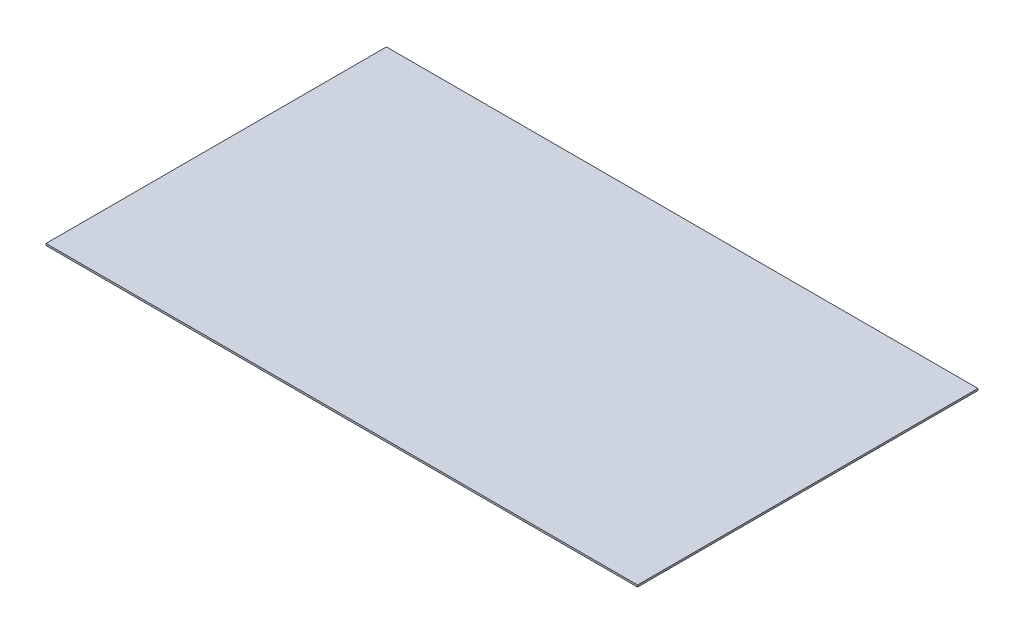
ISO-10303-21;
HEADER;
FILE_DESCRIPTION(('STEP AP214'),'2;1');
FILE_NAME('part.step','',(''),(''),'','','');
FILE_SCHEMA(('AUTOMOTIVE_DESIGN { 1 0 10303 214 1 1 1 1 }'));
ENDSEC;
DATA;
#1=APPLICATION_CONTEXT('core data for automotive mechanical design processes');
#2=APPLICATION_PROTOCOL_DEFINITION('international standard','automotive_design',2000,#1);
#3=PRODUCT_CONTEXT('',#1,'mechanical');
#4=PRODUCT('Part','Part','',(#3));
#5=PRODUCT_RELATED_PRODUCT_CATEGORY('part','',(#4));
#6=PRODUCT_DEFINITION_FORMATION('','',#4);
#7=PRODUCT_DEFINITION_CONTEXT('part definition',#1,'design');
#8=PRODUCT_DEFINITION('design','',#6,#7);
#9=PRODUCT_DEFINITION_SHAPE('','',#8);
#10=(LENGTH_UNIT() NAMED_UNIT(*) SI_UNIT(.MILLI.,.METRE.));
#11=(NAMED_UNIT(*) PLANE_ANGLE_UNIT() SI_UNIT($,.RADIAN.));
#12=(NAMED_UNIT(*) SI_UNIT($,.STERADIAN.) SOLID_ANGLE_UNIT());
#13=UNCERTAINTY_MEASURE_WITH_UNIT(LENGTH_MEASURE(1.E-05),#10,'distance_accuracy_value','');
#14=(GEOMETRIC_REPRESENTATION_CONTEXT(3) GLOBAL_UNCERTAINTY_ASSIGNED_CONTEXT((#13)) GLOBAL_UNIT_ASSIGNED_CONTEXT((#10,
#11,#12)) REPRESENTATION_CONTEXT('',''));
#15=CARTESIAN_POINT('',(0.,0.,0.));
#16=DIRECTION('',(0.,0.,1.));
#17=DIRECTION('',(1.,0.,0.));
#18=AXIS2_PLACEMENT_3D('',#15,#16,#17);
#19=CARTESIAN_POINT('',(213.853908578445,10.,-1756.08589725759));
#20=DIRECTION('',(-1.,0.,0.));
#21=DIRECTION('',(0.,0.,1.));
#22=AXIS2_PLACEMENT_3D('',#19,#20,#21);
#23=PLANE('',#22);
#24=DIRECTION('',(0.,0.,-1.));
#25=VECTOR('',#24,1.);
#26=CARTESIAN_POINT('',(213.853908578445,0.,-1756.08589725759));
#27=LINE('',#26,#25);
#28=CARTESIAN_POINT('',(213.853908578445,0.,91.5704236200257));
#29=VERTEX_POINT('',#28);
#30=CARTESIAN_POINT('',(213.853908578445,0.,-1756.08589725759));
#31=VERTEX_POINT('',#30);
#32=EDGE_CURVE('E96',#29,#31,#27,.T.);
#33=ORIENTED_EDGE('',*,*,#32,.T.);
#34=DIRECTION('',(0.,-1.,0.));
#35=VECTOR('',#34,1.);
#36=CARTESIAN_POINT('',(213.853908578445,10.,-1756.08589725759));
#37=LINE('',#36,#35);
#38=CARTESIAN_POINT('',(213.853908578445,10.,-1756.08589725759));
#39=VERTEX_POINT('',#38);
#40=EDGE_CURVE('E11',#39,#31,#37,.T.);
#41=ORIENTED_EDGE('',*,*,#40,.F.);
#42=DIRECTION('',(0.,0.,-1.));
#43=VECTOR('',#42,1.);
#44=CARTESIAN_POINT('',(213.853908578445,10.,-1756.08589725759));
#45=LINE('',#44,#43);
#46=CARTESIAN_POINT('',(213.853908578445,10.,91.5704236200257));
#47=VERTEX_POINT('',#46);
#48=EDGE_CURVE('E84',#47,#39,#45,.T.);
#49=ORIENTED_EDGE('',*,*,#48,.F.);
#50=DIRECTION('',(0.,-1.,0.));
#51=VECTOR('',#50,1.);
#52=CARTESIAN_POINT('',(213.853908578445,10.,91.5704236200257));
#53=LINE('',#52,#51);
#54=EDGE_CURVE('E92',#47,#29,#53,.T.);
#55=ORIENTED_EDGE('',*,*,#54,.T.);
#56=EDGE_LOOP('',(#33,#41,#49,#55));
#57=FACE_BOUND('',#56,.T.);
#58=ADVANCED_FACE('F33',(#57),#23,.F.);
#59=CARTESIAN_POINT('',(-2996.9130581941,10.,-1756.08589725759));
#60=DIRECTION('',(0.,0.,1.));
#61=DIRECTION('',(1.,0.,0.));
#62=AXIS2_PLACEMENT_3D('',#59,#60,#61);
#63=PLANE('',#62);
#64=DIRECTION('',(-1.,0.,0.));
#65=VECTOR('',#64,1.);
#66=CARTESIAN_POINT('',(-2996.9130581941,0.,-1756.08589725759));
#67=LINE('',#66,#65);
#68=CARTESIAN_POINT('',(-2996.9130581941,0.,-1756.08589725759));
#69=VERTEX_POINT('',#68);
#70=EDGE_CURVE('E88',#31,#69,#67,.T.);
#71=ORIENTED_EDGE('',*,*,#70,.T.);
#72=DIRECTION('',(0.,-1.,0.));
#73=VECTOR('',#72,1.);
#74=CARTESIAN_POINT('',(-2996.9130581941,10.,-1756.08589725759));
#75=LINE('',#74,#73);
#76=CARTESIAN_POINT('',(-2996.9130581941,10.,-1756.08589725759));
#77=VERTEX_POINT('',#76);
#78=EDGE_CURVE('E41',#77,#69,#75,.T.);
#79=ORIENTED_EDGE('',*,*,#78,.F.);
#80=DIRECTION('',(-1.,0.,0.));
#81=VECTOR('',#80,1.);
#82=CARTESIAN_POINT('',(-2996.9130581941,10.,-1756.08589725759));
#83=LINE('',#82,#81);
#84=EDGE_CURVE('E79',#39,#77,#83,.T.);
#85=ORIENTED_EDGE('',*,*,#84,.F.);
#86=ORIENTED_EDGE('',*,*,#40,.T.);
#87=EDGE_LOOP('',(#71,#79,#85,#86));
#88=FACE_BOUND('',#87,.T.);
#89=ADVANCED_FACE('F87',(#88),#63,.F.);
#90=CARTESIAN_POINT('',(-2996.9130581941,10.,-1756.08589725759));
#91=DIRECTION('',(1.,0.,0.));
#92=DIRECTION('',(0.,0.,-1.));
#93=AXIS2_PLACEMENT_3D('',#90,#91,#92);
#94=PLANE('',#93);
#95=DIRECTION('',(0.,0.,1.));
#96=VECTOR('',#95,1.);
#97=CARTESIAN_POINT('',(-2996.9130581941,0.,-1756.08589725759));
#98=LINE('',#97,#96);
#99=CARTESIAN_POINT('',(-2996.9130581941,0.,91.5704236200257));
#100=VERTEX_POINT('',#99);
#101=EDGE_CURVE('E66',#69,#100,#98,.T.);
#102=ORIENTED_EDGE('',*,*,#101,.T.);
#103=DIRECTION('',(0.,-1.,0.));
#104=VECTOR('',#103,1.);
#105=CARTESIAN_POINT('',(-2996.9130581941,10.,91.5704236200257));
#106=LINE('',#105,#104);
#107=CARTESIAN_POINT('',(-2996.9130581941,10.,91.5704236200257));
#108=VERTEX_POINT('',#107);
#109=EDGE_CURVE('E89',#108,#100,#106,.T.);
#110=ORIENTED_EDGE('',*,*,#109,.F.);
#111=DIRECTION('',(0.,0.,1.));
#112=VECTOR('',#111,1.);
#113=CARTESIAN_POINT('',(-2996.9130581941,10.,-1756.08589725759));
#114=LINE('',#113,#112);
#115=EDGE_CURVE('E82',#77,#108,#114,.T.);
#116=ORIENTED_EDGE('',*,*,#115,.F.);
#117=ORIENTED_EDGE('',*,*,#78,.T.);
#118=EDGE_LOOP('',(#102,#110,#116,#117));
#119=FACE_BOUND('',#118,.T.);
#120=ADVANCED_FACE('F90',(#119),#94,.F.);
#121=CARTESIAN_POINT('',(-2996.9130581941,10.,91.5704236200257));
#122=DIRECTION('',(0.,0.,-1.));
#123=DIRECTION('',(-1.,0.,0.));
#124=AXIS2_PLACEMENT_3D('',#121,#122,#123);
#125=PLANE('',#124);
#126=DIRECTION('',(1.,0.,0.));
#127=VECTOR('',#126,1.);
#128=CARTESIAN_POINT('',(-2996.9130581941,0.,91.5704236200257));
#129=LINE('',#128,#127);
#130=EDGE_CURVE('E72',#100,#29,#129,.T.);
#131=ORIENTED_EDGE('',*,*,#130,.T.);
#132=ORIENTED_EDGE('',*,*,#54,.F.);
#133=DIRECTION('',(1.,0.,0.));
#134=VECTOR('',#133,1.);
#135=CARTESIAN_POINT('',(-2996.9130581941,10.,91.5704236200257));
#136=LINE('',#135,#134);
#137=EDGE_CURVE('E49',#108,#47,#136,.T.);
#138=ORIENTED_EDGE('',*,*,#137,.F.);
#139=ORIENTED_EDGE('',*,*,#109,.T.);
#140=EDGE_LOOP('',(#131,#132,#138,#139));
#141=FACE_BOUND('',#140,.T.);
#142=ADVANCED_FACE('F103',(#141),#125,.F.);
#143=CARTESIAN_POINT('',(0.,10.,0.));
#144=DIRECTION('',(0.,1.,0.));
#145=DIRECTION('',(0.,0.,1.));
#146=AXIS2_PLACEMENT_3D('',#143,#144,#145);
#147=PLANE('',#146);
#148=ORIENTED_EDGE('',*,*,#48,.T.);
#149=ORIENTED_EDGE('',*,*,#84,.T.);
#150=ORIENTED_EDGE('',*,*,#115,.T.);
#151=ORIENTED_EDGE('',*,*,#137,.T.);
#152=EDGE_LOOP('',(#148,#149,#150,#151));
#153=FACE_BOUND('',#152,.T.);
#154=ADVANCED_FACE('F80',(#153),#147,.T.);
#155=CARTESIAN_POINT('',(0.,0.,0.));
#156=DIRECTION('',(0.,1.,0.));
#157=DIRECTION('',(0.,0.,1.));
#158=AXIS2_PLACEMENT_3D('',#155,#156,#157);
#159=PLANE('',#158);
#160=ORIENTED_EDGE('',*,*,#32,.F.);
#161=ORIENTED_EDGE('',*,*,#130,.F.);
#162=ORIENTED_EDGE('',*,*,#101,.F.);
#163=ORIENTED_EDGE('',*,*,#70,.F.);
#164=EDGE_LOOP('',(#160,#161,#162,#163));
#165=FACE_BOUND('',#164,.T.);
#166=ADVANCED_FACE('F106',(#165),#159,.F.);
#167=CLOSED_SHELL('',(#58,#89,#120,#142,#154,#166));
#168=MANIFOLD_SOLID_BREP('B2',#167);
#169=ADVANCED_BREP_SHAPE_REPRESENTATION('',(#18,#168),#14);
#170=SHAPE_DEFINITION_REPRESENTATION(#9,#169);
ENDSEC;
END-ISO-10303-21;
